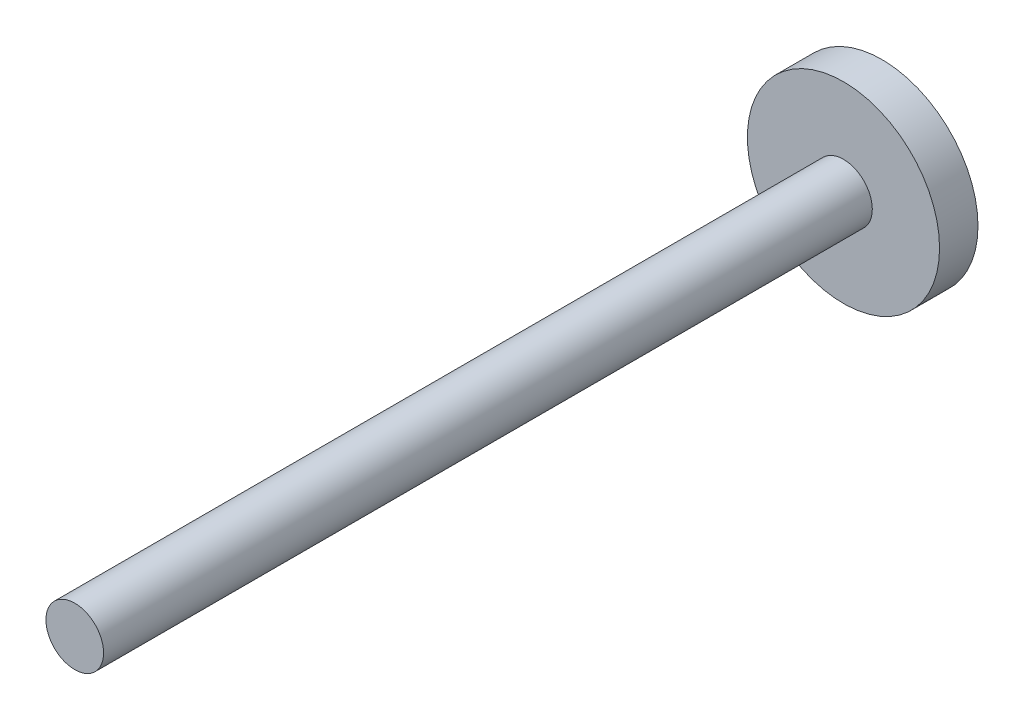
ISO-10303-21;
HEADER;
FILE_DESCRIPTION(('STEP AP214'),'2;1');
FILE_NAME('part.step','',(''),(''),'','','');
FILE_SCHEMA(('AUTOMOTIVE_DESIGN { 1 0 10303 214 1 1 1 1 }'));
ENDSEC;
DATA;
#1=APPLICATION_CONTEXT('core data for automotive mechanical design processes');
#2=APPLICATION_PROTOCOL_DEFINITION('international standard','automotive_design',2000,#1);
#3=PRODUCT_CONTEXT('',#1,'mechanical');
#4=PRODUCT('Part','Part','',(#3));
#5=PRODUCT_RELATED_PRODUCT_CATEGORY('part','',(#4));
#6=PRODUCT_DEFINITION_FORMATION('','',#4);
#7=PRODUCT_DEFINITION_CONTEXT('part definition',#1,'design');
#8=PRODUCT_DEFINITION('design','',#6,#7);
#9=PRODUCT_DEFINITION_SHAPE('','',#8);
#10=(LENGTH_UNIT() NAMED_UNIT(*) SI_UNIT(.MILLI.,.METRE.));
#11=(NAMED_UNIT(*) PLANE_ANGLE_UNIT() SI_UNIT($,.RADIAN.));
#12=(NAMED_UNIT(*) SI_UNIT($,.STERADIAN.) SOLID_ANGLE_UNIT());
#13=UNCERTAINTY_MEASURE_WITH_UNIT(LENGTH_MEASURE(1.E-05),#10,'distance_accuracy_value','');
#14=(GEOMETRIC_REPRESENTATION_CONTEXT(3) GLOBAL_UNCERTAINTY_ASSIGNED_CONTEXT((#13)) GLOBAL_UNIT_ASSIGNED_CONTEXT((#10,
#11,#12)) REPRESENTATION_CONTEXT('',''));
#15=CARTESIAN_POINT('',(0.,0.,0.));
#16=DIRECTION('',(0.,0.,1.));
#17=DIRECTION('',(1.,0.,0.));
#18=AXIS2_PLACEMENT_3D('',#15,#16,#17);
#19=CARTESIAN_POINT('',(0.,0.,4.));
#20=DIRECTION('',(0.,0.,-1.));
#21=DIRECTION('',(-1.,0.,0.));
#22=AXIS2_PLACEMENT_3D('',#19,#20,#21);
#23=CYLINDRICAL_SURFACE('',#22,10.);
#24=CARTESIAN_POINT('',(0.,0.,4.));
#25=DIRECTION('',(0.,0.,1.));
#26=DIRECTION('',(1.,0.,0.));
#27=AXIS2_PLACEMENT_3D('',#24,#25,#26);
#28=CIRCLE('',#27,10.);
#29=CARTESIAN_POINT('',(10.,0.,4.));
#30=VERTEX_POINT('',#29);
#31=EDGE_CURVE('E48',#30,#30,#28,.T.);
#32=ORIENTED_EDGE('',*,*,#31,.F.);
#33=EDGE_LOOP('',(#32));
#34=FACE_BOUND('',#33,.T.);
#35=CARTESIAN_POINT('',(0.,0.,0.));
#36=DIRECTION('',(0.,0.,1.));
#37=DIRECTION('',(1.,0.,0.));
#38=AXIS2_PLACEMENT_3D('',#35,#36,#37);
#39=CIRCLE('',#38,10.);
#40=CARTESIAN_POINT('',(10.,0.,0.));
#41=VERTEX_POINT('',#40);
#42=EDGE_CURVE('E42',#41,#41,#39,.T.);
#43=ORIENTED_EDGE('',*,*,#42,.T.);
#44=EDGE_LOOP('',(#43));
#45=FACE_BOUND('',#44,.T.);
#46=ADVANCED_FACE('F39',(#34,#45),#23,.T.);
#47=CARTESIAN_POINT('',(0.,0.,4.));
#48=DIRECTION('',(0.,0.,1.));
#49=DIRECTION('',(1.,0.,0.));
#50=AXIS2_PLACEMENT_3D('',#47,#48,#49);
#51=PLANE('',#50);
#52=CARTESIAN_POINT('',(0.,0.,4.));
#53=DIRECTION('',(0.,0.,1.));
#54=DIRECTION('',(1.,0.,0.));
#55=AXIS2_PLACEMENT_3D('',#52,#53,#54);
#56=CIRCLE('',#55,3.);
#57=CARTESIAN_POINT('',(3.,0.,4.));
#58=VERTEX_POINT('',#57);
#59=EDGE_CURVE('E11',#58,#58,#56,.T.);
#60=ORIENTED_EDGE('',*,*,#59,.F.);
#61=EDGE_LOOP('',(#60));
#62=FACE_BOUND('',#61,.T.);
#63=ORIENTED_EDGE('',*,*,#31,.T.);
#64=EDGE_LOOP('',(#63));
#65=FACE_BOUND('',#64,.T.);
#66=ADVANCED_FACE('F179',(#62,#65),#51,.T.);
#67=CARTESIAN_POINT('',(0.,0.,0.));
#68=DIRECTION('',(0.,0.,1.));
#69=DIRECTION('',(1.,0.,0.));
#70=AXIS2_PLACEMENT_3D('',#67,#68,#69);
#71=PLANE('',#70);
#72=DIRECTION('',(0.495349522151199,-0.868693761290237,0.));
#73=VECTOR('',#72,1.);
#74=CARTESIAN_POINT('',(4.14838425591465,7.09706156673935,0.));
#75=LINE('',#74,#73);
#76=CARTESIAN_POINT('',(4.14838425591465,7.09706156673935,0.));
#77=VERTEX_POINT('',#76);
#78=CARTESIAN_POINT('',(8.22042773697579,-0.044075366911828,0.));
#79=VERTEX_POINT('',#78);
#80=EDGE_CURVE('E136',#77,#79,#75,.T.);
#81=ORIENTED_EDGE('',*,*,#80,.F.);
#82=DIRECTION('',(0.999985626462,-0.00536161070969749,0.));
#83=VECTOR('',#82,1.);
#84=CARTESIAN_POINT('',(-4.07204348106114,7.14113693365117,0.));
#85=LINE('',#84,#83);
#86=CARTESIAN_POINT('',(-4.07204348106114,7.14113693365117,0.));
#87=VERTEX_POINT('',#86);
#88=EDGE_CURVE('E56',#87,#77,#85,.T.);
#89=ORIENTED_EDGE('',*,*,#88,.F.);
#90=DIRECTION('',(0.5046361043108,0.863332150580539,0.));
#91=VECTOR('',#90,1.);
#92=CARTESIAN_POINT('',(-8.22042773697579,0.0440753669118263,0.));
#93=LINE('',#92,#91);
#94=CARTESIAN_POINT('',(-8.22042773697579,0.0440753669118263,0.));
#95=VERTEX_POINT('',#94);
#96=EDGE_CURVE('E149',#95,#87,#93,.T.);
#97=ORIENTED_EDGE('',*,*,#96,.F.);
#98=DIRECTION('',(-0.495349522151199,0.868693761290237,0.));
#99=VECTOR('',#98,1.);
#100=CARTESIAN_POINT('',(-4.14838425591465,-7.09706156673934,0.));
#101=LINE('',#100,#99);
#102=CARTESIAN_POINT('',(-4.14838425591465,-7.09706156673934,0.));
#103=VERTEX_POINT('',#102);
#104=EDGE_CURVE('E146',#103,#95,#101,.T.);
#105=ORIENTED_EDGE('',*,*,#104,.F.);
#106=DIRECTION('',(-0.999985626462,0.0053616107096976,0.));
#107=VECTOR('',#106,1.);
#108=CARTESIAN_POINT('',(4.07204348106113,-7.14113693365117,0.));
#109=LINE('',#108,#107);
#110=CARTESIAN_POINT('',(4.07204348106113,-7.14113693365117,0.));
#111=VERTEX_POINT('',#110);
#112=EDGE_CURVE('E104',#111,#103,#109,.T.);
#113=ORIENTED_EDGE('',*,*,#112,.F.);
#114=DIRECTION('',(-0.504636104310801,-0.863332150580539,0.));
#115=VECTOR('',#114,1.);
#116=CARTESIAN_POINT('',(8.22042773697579,-0.044075366911828,0.));
#117=LINE('',#116,#115);
#118=EDGE_CURVE('E140',#79,#111,#117,.T.);
#119=ORIENTED_EDGE('',*,*,#118,.F.);
#120=EDGE_LOOP('',(#81,#89,#97,#105,#113,#119));
#121=FACE_BOUND('',#120,.T.);
#122=ORIENTED_EDGE('',*,*,#42,.F.);
#123=EDGE_LOOP('',(#122));
#124=FACE_BOUND('',#123,.T.);
#125=ADVANCED_FACE('F176',(#121,#124),#71,.F.);
#126=CARTESIAN_POINT('',(0.,0.,84.));
#127=DIRECTION('',(0.,0.,-1.));
#128=DIRECTION('',(-1.,0.,0.));
#129=AXIS2_PLACEMENT_3D('',#126,#127,#128);
#130=CYLINDRICAL_SURFACE('',#129,3.);
#131=CARTESIAN_POINT('',(0.,0.,84.));
#132=DIRECTION('',(0.,0.,1.));
#133=DIRECTION('',(1.,0.,0.));
#134=AXIS2_PLACEMENT_3D('',#131,#132,#133);
#135=CIRCLE('',#134,3.);
#136=CARTESIAN_POINT('',(3.,0.,84.));
#137=VERTEX_POINT('',#136);
#138=EDGE_CURVE('E155',#137,#137,#135,.T.);
#139=ORIENTED_EDGE('',*,*,#138,.F.);
#140=EDGE_LOOP('',(#139));
#141=FACE_BOUND('',#140,.T.);
#142=ORIENTED_EDGE('',*,*,#59,.T.);
#143=EDGE_LOOP('',(#142));
#144=FACE_BOUND('',#143,.T.);
#145=ADVANCED_FACE('F178',(#141,#144),#130,.T.);
#146=CARTESIAN_POINT('',(0.,0.,84.));
#147=DIRECTION('',(0.,0.,1.));
#148=DIRECTION('',(1.,0.,0.));
#149=AXIS2_PLACEMENT_3D('',#146,#147,#148);
#150=PLANE('',#149);
#151=ORIENTED_EDGE('',*,*,#138,.T.);
#152=EDGE_LOOP('',(#151));
#153=FACE_BOUND('',#152,.T.);
#154=ADVANCED_FACE('F185',(#153),#150,.T.);
#155=CARTESIAN_POINT('',(-4.07204348106114,7.14113693365117,2.));
#156=DIRECTION('',(0.00536161070969749,0.999985626462,0.));
#157=DIRECTION('',(-0.999985626462,0.00536161070969749,0.));
#158=AXIS2_PLACEMENT_3D('',#155,#156,#157);
#159=PLANE('',#158);
#160=ORIENTED_EDGE('',*,*,#88,.T.);
#161=DIRECTION('',(0.,0.,-1.));
#162=VECTOR('',#161,1.);
#163=CARTESIAN_POINT('',(4.14838425591465,7.09706156673935,2.));
#164=LINE('',#163,#162);
#165=CARTESIAN_POINT('',(4.14838425591465,7.09706156673935,2.));
#166=VERTEX_POINT('',#165);
#167=EDGE_CURVE('E86',#166,#77,#164,.T.);
#168=ORIENTED_EDGE('',*,*,#167,.F.);
#169=DIRECTION('',(0.999985626462,-0.00536161070969749,0.));
#170=VECTOR('',#169,1.);
#171=CARTESIAN_POINT('',(-4.07204348106114,7.14113693365117,2.));
#172=LINE('',#171,#170);
#173=CARTESIAN_POINT('',(-4.07204348106114,7.14113693365117,2.));
#174=VERTEX_POINT('',#173);
#175=EDGE_CURVE('E152',#174,#166,#172,.T.);
#176=ORIENTED_EDGE('',*,*,#175,.F.);
#177=DIRECTION('',(0.,0.,-1.));
#178=VECTOR('',#177,1.);
#179=CARTESIAN_POINT('',(-4.07204348106114,7.14113693365117,2.));
#180=LINE('',#179,#178);
#181=EDGE_CURVE('E64',#174,#87,#180,.T.);
#182=ORIENTED_EDGE('',*,*,#181,.T.);
#183=EDGE_LOOP('',(#160,#168,#176,#182));
#184=FACE_BOUND('',#183,.T.);
#185=ADVANCED_FACE('F214',(#184),#159,.F.);
#186=CARTESIAN_POINT('',(-8.22042773697579,0.0440753669118263,2.));
#187=DIRECTION('',(-0.86333215058054,0.5046361043108,0.));
#188=DIRECTION('',(-0.5046361043108,-0.863332150580539,0.));
#189=AXIS2_PLACEMENT_3D('',#186,#187,#188);
#190=PLANE('',#189);
#191=ORIENTED_EDGE('',*,*,#96,.T.);
#192=ORIENTED_EDGE('',*,*,#181,.F.);
#193=DIRECTION('',(0.5046361043108,0.863332150580539,0.));
#194=VECTOR('',#193,1.);
#195=CARTESIAN_POINT('',(-8.22042773697579,0.0440753669118263,2.));
#196=LINE('',#195,#194);
#197=CARTESIAN_POINT('',(-8.22042773697579,0.0440753669118263,2.));
#198=VERTEX_POINT('',#197);
#199=EDGE_CURVE('E118',#198,#174,#196,.T.);
#200=ORIENTED_EDGE('',*,*,#199,.F.);
#201=DIRECTION('',(0.,0.,-1.));
#202=VECTOR('',#201,1.);
#203=CARTESIAN_POINT('',(-8.22042773697579,0.0440753669118263,2.));
#204=LINE('',#203,#202);
#205=EDGE_CURVE('E109',#198,#95,#204,.T.);
#206=ORIENTED_EDGE('',*,*,#205,.T.);
#207=EDGE_LOOP('',(#191,#192,#200,#206));
#208=FACE_BOUND('',#207,.T.);
#209=ADVANCED_FACE('F228',(#208),#190,.F.);
#210=CARTESIAN_POINT('',(-4.14838425591465,-7.09706156673934,2.));
#211=DIRECTION('',(-0.868693761290237,-0.495349522151199,0.));
#212=DIRECTION('',(0.495349522151199,-0.868693761290237,0.));
#213=AXIS2_PLACEMENT_3D('',#210,#211,#212);
#214=PLANE('',#213);
#215=ORIENTED_EDGE('',*,*,#104,.T.);
#216=ORIENTED_EDGE('',*,*,#205,.F.);
#217=DIRECTION('',(-0.495349522151199,0.868693761290237,0.));
#218=VECTOR('',#217,1.);
#219=CARTESIAN_POINT('',(-4.14838425591465,-7.09706156673934,2.));
#220=LINE('',#219,#218);
#221=CARTESIAN_POINT('',(-4.14838425591465,-7.09706156673934,2.));
#222=VERTEX_POINT('',#221);
#223=EDGE_CURVE('E113',#222,#198,#220,.T.);
#224=ORIENTED_EDGE('',*,*,#223,.F.);
#225=DIRECTION('',(0.,0.,-1.));
#226=VECTOR('',#225,1.);
#227=CARTESIAN_POINT('',(-4.14838425591465,-7.09706156673934,2.));
#228=LINE('',#227,#226);
#229=EDGE_CURVE('E97',#222,#103,#228,.T.);
#230=ORIENTED_EDGE('',*,*,#229,.T.);
#231=EDGE_LOOP('',(#215,#216,#224,#230));
#232=FACE_BOUND('',#231,.T.);
#233=ADVANCED_FACE('F114',(#232),#214,.F.);
#234=CARTESIAN_POINT('',(4.07204348106113,-7.14113693365117,2.));
#235=DIRECTION('',(-0.0053616107096976,-0.999985626462,0.));
#236=DIRECTION('',(0.999985626462,-0.0053616107096976,0.));
#237=AXIS2_PLACEMENT_3D('',#234,#235,#236);
#238=PLANE('',#237);
#239=ORIENTED_EDGE('',*,*,#112,.T.);
#240=ORIENTED_EDGE('',*,*,#229,.F.);
#241=DIRECTION('',(-0.999985626462,0.0053616107096976,0.));
#242=VECTOR('',#241,1.);
#243=CARTESIAN_POINT('',(4.07204348106113,-7.14113693365117,2.));
#244=LINE('',#243,#242);
#245=CARTESIAN_POINT('',(4.07204348106113,-7.14113693365117,2.));
#246=VERTEX_POINT('',#245);
#247=EDGE_CURVE('E101',#246,#222,#244,.T.);
#248=ORIENTED_EDGE('',*,*,#247,.F.);
#249=DIRECTION('',(0.,0.,-1.));
#250=VECTOR('',#249,1.);
#251=CARTESIAN_POINT('',(4.07204348106113,-7.14113693365117,2.));
#252=LINE('',#251,#250);
#253=EDGE_CURVE('E110',#246,#111,#252,.T.);
#254=ORIENTED_EDGE('',*,*,#253,.T.);
#255=EDGE_LOOP('',(#239,#240,#248,#254));
#256=FACE_BOUND('',#255,.T.);
#257=ADVANCED_FACE('F99',(#256),#238,.F.);
#258=CARTESIAN_POINT('',(8.22042773697579,-0.044075366911828,2.));
#259=DIRECTION('',(0.863332150580539,-0.504636104310801,0.));
#260=DIRECTION('',(0.504636104310801,0.863332150580539,0.));
#261=AXIS2_PLACEMENT_3D('',#258,#259,#260);
#262=PLANE('',#261);
#263=ORIENTED_EDGE('',*,*,#118,.T.);
#264=ORIENTED_EDGE('',*,*,#253,.F.);
#265=DIRECTION('',(-0.504636104310801,-0.863332150580539,0.));
#266=VECTOR('',#265,1.);
#267=CARTESIAN_POINT('',(8.22042773697579,-0.044075366911828,2.));
#268=LINE('',#267,#266);
#269=CARTESIAN_POINT('',(8.22042773697579,-0.044075366911828,2.));
#270=VERTEX_POINT('',#269);
#271=EDGE_CURVE('E124',#270,#246,#268,.T.);
#272=ORIENTED_EDGE('',*,*,#271,.F.);
#273=DIRECTION('',(0.,0.,-1.));
#274=VECTOR('',#273,1.);
#275=CARTESIAN_POINT('',(8.22042773697579,-0.044075366911828,2.));
#276=LINE('',#275,#274);
#277=EDGE_CURVE('E160',#270,#79,#276,.T.);
#278=ORIENTED_EDGE('',*,*,#277,.T.);
#279=EDGE_LOOP('',(#263,#264,#272,#278));
#280=FACE_BOUND('',#279,.T.);
#281=ADVANCED_FACE('F253',(#280),#262,.F.);
#282=CARTESIAN_POINT('',(4.14838425591465,7.09706156673935,2.));
#283=DIRECTION('',(0.868693761290237,0.495349522151199,0.));
#284=DIRECTION('',(-0.495349522151199,0.868693761290237,0.));
#285=AXIS2_PLACEMENT_3D('',#282,#283,#284);
#286=PLANE('',#285);
#287=ORIENTED_EDGE('',*,*,#80,.T.);
#288=ORIENTED_EDGE('',*,*,#277,.F.);
#289=DIRECTION('',(0.495349522151199,-0.868693761290237,0.));
#290=VECTOR('',#289,1.);
#291=CARTESIAN_POINT('',(4.14838425591465,7.09706156673935,2.));
#292=LINE('',#291,#290);
#293=EDGE_CURVE('E128',#166,#270,#292,.T.);
#294=ORIENTED_EDGE('',*,*,#293,.F.);
#295=ORIENTED_EDGE('',*,*,#167,.T.);
#296=EDGE_LOOP('',(#287,#288,#294,#295));
#297=FACE_BOUND('',#296,.T.);
#298=ADVANCED_FACE('F262',(#297),#286,.F.);
#299=CARTESIAN_POINT('',(0.,0.,2.));
#300=DIRECTION('',(0.,0.,-1.));
#301=DIRECTION('',(-1.,0.,0.));
#302=AXIS2_PLACEMENT_3D('',#299,#300,#301);
#303=PLANE('',#302);
#304=ORIENTED_EDGE('',*,*,#175,.T.);
#305=ORIENTED_EDGE('',*,*,#293,.T.);
#306=ORIENTED_EDGE('',*,*,#271,.T.);
#307=ORIENTED_EDGE('',*,*,#247,.T.);
#308=ORIENTED_EDGE('',*,*,#223,.T.);
#309=ORIENTED_EDGE('',*,*,#199,.T.);
#310=EDGE_LOOP('',(#304,#305,#306,#307,#308,#309));
#311=FACE_BOUND('',#310,.T.);
#312=ADVANCED_FACE('F121',(#311),#303,.T.);
#313=CLOSED_SHELL('',(#46,#66,#125,#145,#154,#185,#209,#233,#257,#281,#298,#312));
#314=MANIFOLD_SOLID_BREP('B2',#313);
#315=ADVANCED_BREP_SHAPE_REPRESENTATION('',(#18,#314),#14);
#316=SHAPE_DEFINITION_REPRESENTATION(#9,#315);
ENDSEC;
END-ISO-10303-21;
